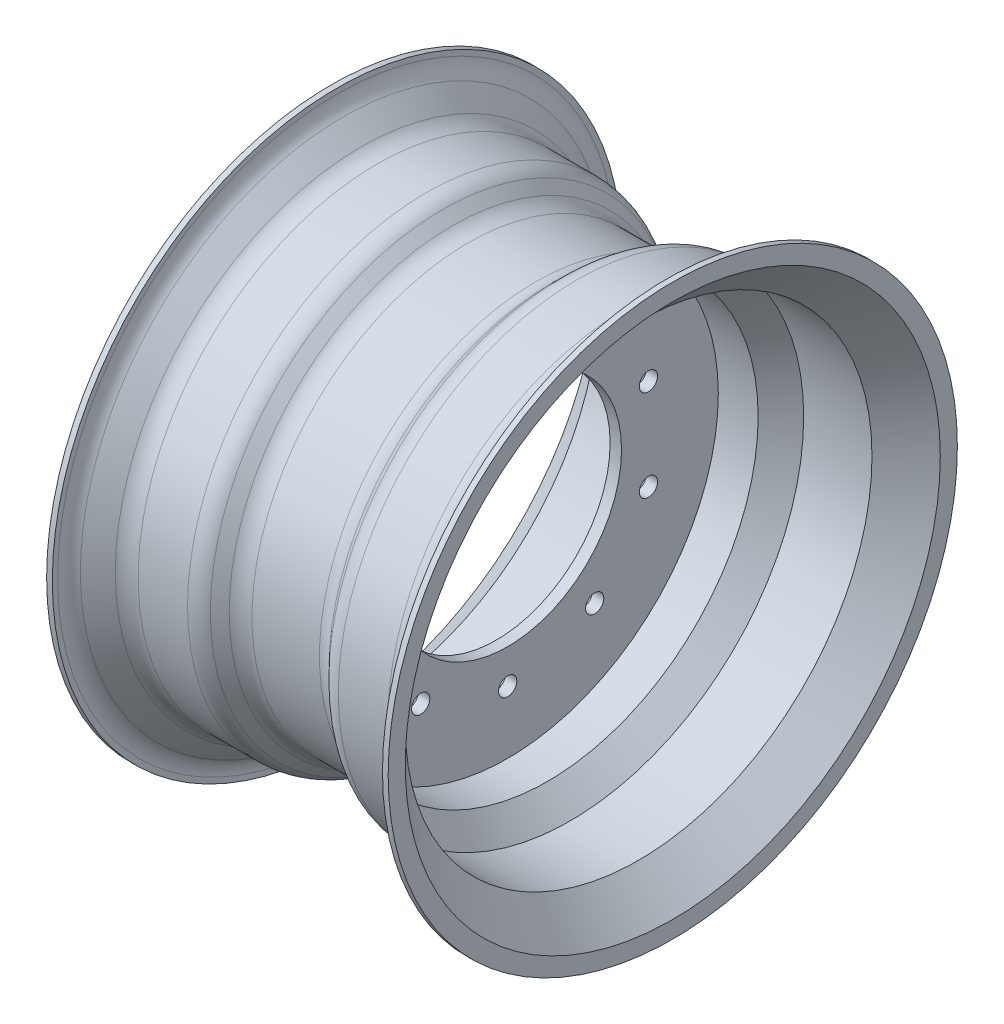
ISO-10303-21;
HEADER;
FILE_DESCRIPTION(('STEP AP214'),'2;1');
FILE_NAME('part.step','',(''),(''),'','','');
FILE_SCHEMA(('AUTOMOTIVE_DESIGN { 1 0 10303 214 1 1 1 1 }'));
ENDSEC;
DATA;
#1=APPLICATION_CONTEXT('core data for automotive mechanical design processes');
#2=APPLICATION_PROTOCOL_DEFINITION('international standard','automotive_design',2000,#1);
#3=PRODUCT_CONTEXT('',#1,'mechanical');
#4=PRODUCT('Part','Part','',(#3));
#5=PRODUCT_RELATED_PRODUCT_CATEGORY('part','',(#4));
#6=PRODUCT_DEFINITION_FORMATION('','',#4);
#7=PRODUCT_DEFINITION_CONTEXT('part definition',#1,'design');
#8=PRODUCT_DEFINITION('design','',#6,#7);
#9=PRODUCT_DEFINITION_SHAPE('','',#8);
#10=(LENGTH_UNIT() NAMED_UNIT(*) SI_UNIT(.MILLI.,.METRE.));
#11=(NAMED_UNIT(*) PLANE_ANGLE_UNIT() SI_UNIT($,.RADIAN.));
#12=(NAMED_UNIT(*) SI_UNIT($,.STERADIAN.) SOLID_ANGLE_UNIT());
#13=UNCERTAINTY_MEASURE_WITH_UNIT(LENGTH_MEASURE(1.E-05),#10,'distance_accuracy_value','');
#14=(GEOMETRIC_REPRESENTATION_CONTEXT(3) GLOBAL_UNCERTAINTY_ASSIGNED_CONTEXT((#13)) GLOBAL_UNIT_ASSIGNED_CONTEXT((#10,
#11,#12)) REPRESENTATION_CONTEXT('',''));
#15=CARTESIAN_POINT('',(0.,0.,0.));
#16=DIRECTION('',(0.,0.,1.));
#17=DIRECTION('',(1.,0.,0.));
#18=AXIS2_PLACEMENT_3D('',#15,#16,#17);
#19=CARTESIAN_POINT('',(0.,0.,0.));
#20=DIRECTION('',(1.,0.,0.));
#21=DIRECTION('',(0.,0.,-1.));
#22=AXIS2_PLACEMENT_3D('',#19,#20,#21);
#23=CYLINDRICAL_SURFACE('',#22,250.);
#24=CARTESIAN_POINT('',(-150.,0.,0.));
#25=DIRECTION('',(1.,0.,0.));
#26=DIRECTION('',(0.,0.,-1.));
#27=AXIS2_PLACEMENT_3D('',#24,#25,#26);
#28=CIRCLE('',#27,250.);
#29=CARTESIAN_POINT('',(-150.,0.,-250.));
#30=VERTEX_POINT('',#29);
#31=EDGE_CURVE('E133',#30,#30,#28,.T.);
#32=ORIENTED_EDGE('',*,*,#31,.T.);
#33=EDGE_LOOP('',(#32));
#34=FACE_BOUND('',#33,.T.);
#35=CARTESIAN_POINT('',(-145.,0.,0.));
#36=DIRECTION('',(1.,0.,0.));
#37=DIRECTION('',(0.,0.,-1.));
#38=AXIS2_PLACEMENT_3D('',#35,#36,#37);
#39=CIRCLE('',#38,250.);
#40=CARTESIAN_POINT('',(-145.,0.,-250.));
#41=VERTEX_POINT('',#40);
#42=EDGE_CURVE('E88',#41,#41,#39,.T.);
#43=ORIENTED_EDGE('',*,*,#42,.F.);
#44=EDGE_LOOP('',(#43));
#45=FACE_BOUND('',#44,.T.);
#46=ADVANCED_FACE('F32',(#34,#45),#23,.T.);
#47=CARTESIAN_POINT('',(-145.,250.,0.));
#48=DIRECTION('',(1.,0.,0.));
#49=DIRECTION('',(0.,0.,-1.));
#50=AXIS2_PLACEMENT_3D('',#47,#48,#49);
#51=PLANE('',#50);
#52=CARTESIAN_POINT('',(-145.,0.,0.));
#53=DIRECTION('',(1.,0.,0.));
#54=DIRECTION('',(0.,0.,-1.));
#55=AXIS2_PLACEMENT_3D('',#52,#53,#54);
#56=CIRCLE('',#55,245.355339059327);
#57=CARTESIAN_POINT('',(-145.,0.,-245.355339059327));
#58=VERTEX_POINT('',#57);
#59=EDGE_CURVE('E10',#58,#58,#56,.F.);
#60=ORIENTED_EDGE('',*,*,#59,.T.);
#61=EDGE_LOOP('',(#60));
#62=FACE_BOUND('',#61,.T.);
#63=ORIENTED_EDGE('',*,*,#42,.T.);
#64=EDGE_LOOP('',(#63));
#65=FACE_BOUND('',#64,.T.);
#66=ADVANCED_FACE('F267',(#62,#65),#51,.T.);
#67=CARTESIAN_POINT('',(-117.928932188134,0.,0.));
#68=DIRECTION('',(-1.,0.,0.));
#69=DIRECTION('',(0.,0.,1.));
#70=AXIS2_PLACEMENT_3D('',#67,#68,#69);
#71=CONICAL_SURFACE('',#70,210.,0.785398163397445);
#72=CARTESIAN_POINT('',(-123.786796564403,0.,0.));
#73=DIRECTION('',(-1.,0.,0.));
#74=DIRECTION('',(0.,0.,1.));
#75=AXIS2_PLACEMENT_3D('',#72,#73,#74);
#76=CIRCLE('',#75,215.857864376269);
#77=CARTESIAN_POINT('',(-123.786796564403,0.,215.857864376269));
#78=VERTEX_POINT('',#77);
#79=EDGE_CURVE('E43',#78,#78,#76,.T.);
#80=ORIENTED_EDGE('',*,*,#79,.T.);
#81=EDGE_LOOP('',(#80));
#82=FACE_BOUND('',#81,.T.);
#83=CARTESIAN_POINT('',(-139.142135623731,0.,0.));
#84=DIRECTION('',(-1.,0.,0.));
#85=DIRECTION('',(0.,0.,1.));
#86=AXIS2_PLACEMENT_3D('',#83,#84,#85);
#87=CIRCLE('',#86,231.213203435596);
#88=CARTESIAN_POINT('',(-139.142135623731,0.,231.213203435596));
#89=VERTEX_POINT('',#88);
#90=EDGE_CURVE('E47',#89,#89,#87,.F.);
#91=ORIENTED_EDGE('',*,*,#90,.T.);
#92=EDGE_LOOP('',(#91));
#93=FACE_BOUND('',#92,.T.);
#94=ADVANCED_FACE('F272',(#82,#93),#71,.T.);
#95=CARTESIAN_POINT('',(0.,0.,0.));
#96=DIRECTION('',(1.,0.,0.));
#97=DIRECTION('',(0.,0.,-1.));
#98=AXIS2_PLACEMENT_3D('',#95,#96,#97);
#99=CYLINDRICAL_SURFACE('',#98,210.);
#100=CARTESIAN_POINT('',(-66.2132034355965,0.,0.));
#101=DIRECTION('',(-1.,0.,0.));
#102=DIRECTION('',(0.,0.,1.));
#103=AXIS2_PLACEMENT_3D('',#100,#101,#102);
#104=CIRCLE('',#103,210.);
#105=CARTESIAN_POINT('',(-66.2132034355965,0.,210.));
#106=VERTEX_POINT('',#105);
#107=EDGE_CURVE('E52',#106,#106,#104,.T.);
#108=ORIENTED_EDGE('',*,*,#107,.T.);
#109=EDGE_LOOP('',(#108));
#110=FACE_BOUND('',#109,.T.);
#111=CARTESIAN_POINT('',(-109.644660940673,0.,0.));
#112=DIRECTION('',(1.,0.,0.));
#113=DIRECTION('',(0.,0.,-1.));
#114=AXIS2_PLACEMENT_3D('',#111,#112,#113);
#115=CIRCLE('',#114,210.);
#116=CARTESIAN_POINT('',(-109.644660940673,0.,-210.));
#117=VERTEX_POINT('',#116);
#118=EDGE_CURVE('E55',#117,#117,#115,.T.);
#119=ORIENTED_EDGE('',*,*,#118,.T.);
#120=EDGE_LOOP('',(#119));
#121=FACE_BOUND('',#120,.T.);
#122=ADVANCED_FACE('F277',(#110,#121),#99,.T.);
#123=CARTESIAN_POINT('',(-37.9289321881345,0.,0.));
#124=DIRECTION('',(-1.,0.,0.));
#125=DIRECTION('',(0.,0.,1.));
#126=AXIS2_PLACEMENT_3D('',#123,#124,#125);
#127=CONICAL_SURFACE('',#126,190.,0.785398163397448);
#128=CARTESIAN_POINT('',(-43.7867965644036,0.,0.));
#129=DIRECTION('',(-1.,0.,0.));
#130=DIRECTION('',(0.,0.,1.));
#131=AXIS2_PLACEMENT_3D('',#128,#129,#130);
#132=CIRCLE('',#131,195.857864376269);
#133=CARTESIAN_POINT('',(-43.7867965644036,0.,195.857864376269));
#134=VERTEX_POINT('',#133);
#135=EDGE_CURVE('E58',#134,#134,#132,.T.);
#136=ORIENTED_EDGE('',*,*,#135,.T.);
#137=EDGE_LOOP('',(#136));
#138=FACE_BOUND('',#137,.T.);
#139=CARTESIAN_POINT('',(-52.0710678118655,0.,0.));
#140=DIRECTION('',(1.,0.,0.));
#141=DIRECTION('',(0.,0.,-1.));
#142=AXIS2_PLACEMENT_3D('',#139,#140,#141);
#143=CIRCLE('',#142,204.142135623731);
#144=CARTESIAN_POINT('',(-52.0710678118655,0.,-204.142135623731));
#145=VERTEX_POINT('',#144);
#146=EDGE_CURVE('E61',#145,#145,#143,.T.);
#147=ORIENTED_EDGE('',*,*,#146,.T.);
#148=EDGE_LOOP('',(#147));
#149=FACE_BOUND('',#148,.T.);
#150=ADVANCED_FACE('F338',(#138,#149),#127,.T.);
#151=CARTESIAN_POINT('',(0.,0.,0.));
#152=DIRECTION('',(1.,0.,0.));
#153=DIRECTION('',(0.,0.,-1.));
#154=AXIS2_PLACEMENT_3D('',#151,#152,#153);
#155=CYLINDRICAL_SURFACE('',#154,190.);
#156=CARTESIAN_POINT('',(29.6446609406726,0.,0.));
#157=DIRECTION('',(1.,0.,0.));
#158=DIRECTION('',(0.,0.,-1.));
#159=AXIS2_PLACEMENT_3D('',#156,#157,#158);
#160=CIRCLE('',#159,190.);
#161=CARTESIAN_POINT('',(29.6446609406726,0.,-190.));
#162=VERTEX_POINT('',#161);
#163=EDGE_CURVE('E64',#162,#162,#160,.F.);
#164=ORIENTED_EDGE('',*,*,#163,.T.);
#165=EDGE_LOOP('',(#164));
#166=FACE_BOUND('',#165,.T.);
#167=CARTESIAN_POINT('',(-29.6446609406726,0.,0.));
#168=DIRECTION('',(1.,0.,0.));
#169=DIRECTION('',(0.,0.,-1.));
#170=AXIS2_PLACEMENT_3D('',#167,#168,#169);
#171=CIRCLE('',#170,190.);
#172=CARTESIAN_POINT('',(-29.6446609406726,0.,-190.));
#173=VERTEX_POINT('',#172);
#174=EDGE_CURVE('E67',#173,#173,#171,.T.);
#175=ORIENTED_EDGE('',*,*,#174,.T.);
#176=EDGE_LOOP('',(#175));
#177=FACE_BOUND('',#176,.T.);
#178=ADVANCED_FACE('F334',(#166,#177),#155,.T.);
#179=CARTESIAN_POINT('',(57.9289321881346,0.,0.));
#180=DIRECTION('',(1.,0.,0.));
#181=DIRECTION('',(0.,0.,-1.));
#182=AXIS2_PLACEMENT_3D('',#179,#180,#181);
#183=CONICAL_SURFACE('',#182,210.,0.785398163397448);
#184=CARTESIAN_POINT('',(52.0710678118655,0.,0.));
#185=DIRECTION('',(-1.,0.,0.));
#186=DIRECTION('',(0.,0.,1.));
#187=AXIS2_PLACEMENT_3D('',#184,#185,#186);
#188=CIRCLE('',#187,204.142135623731);
#189=CARTESIAN_POINT('',(52.0710678118655,0.,204.142135623731));
#190=VERTEX_POINT('',#189);
#191=EDGE_CURVE('E70',#190,#190,#188,.T.);
#192=ORIENTED_EDGE('',*,*,#191,.T.);
#193=EDGE_LOOP('',(#192));
#194=FACE_BOUND('',#193,.T.);
#195=CARTESIAN_POINT('',(43.7867965644036,0.,0.));
#196=DIRECTION('',(1.,0.,0.));
#197=DIRECTION('',(0.,0.,-1.));
#198=AXIS2_PLACEMENT_3D('',#195,#196,#197);
#199=CIRCLE('',#198,195.857864376269);
#200=CARTESIAN_POINT('',(43.7867965644036,0.,-195.857864376269));
#201=VERTEX_POINT('',#200);
#202=EDGE_CURVE('E73',#201,#201,#199,.T.);
#203=ORIENTED_EDGE('',*,*,#202,.T.);
#204=EDGE_LOOP('',(#203));
#205=FACE_BOUND('',#204,.T.);
#206=ADVANCED_FACE('F327',(#194,#205),#183,.T.);
#207=CARTESIAN_POINT('',(0.,0.,0.));
#208=DIRECTION('',(1.,0.,0.));
#209=DIRECTION('',(0.,0.,-1.));
#210=AXIS2_PLACEMENT_3D('',#207,#208,#209);
#211=CYLINDRICAL_SURFACE('',#210,210.);
#212=CARTESIAN_POINT('',(109.644660940673,0.,0.));
#213=DIRECTION('',(1.,0.,0.));
#214=DIRECTION('',(0.,0.,-1.));
#215=AXIS2_PLACEMENT_3D('',#212,#213,#214);
#216=CIRCLE('',#215,210.);
#217=CARTESIAN_POINT('',(109.644660940673,0.,-210.));
#218=VERTEX_POINT('',#217);
#219=EDGE_CURVE('E76',#218,#218,#216,.F.);
#220=ORIENTED_EDGE('',*,*,#219,.T.);
#221=EDGE_LOOP('',(#220));
#222=FACE_BOUND('',#221,.T.);
#223=CARTESIAN_POINT('',(66.2132034355965,0.,0.));
#224=DIRECTION('',(-1.,0.,0.));
#225=DIRECTION('',(0.,0.,1.));
#226=AXIS2_PLACEMENT_3D('',#223,#224,#225);
#227=CIRCLE('',#226,210.);
#228=CARTESIAN_POINT('',(66.2132034355965,0.,210.));
#229=VERTEX_POINT('',#228);
#230=EDGE_CURVE('E79',#229,#229,#227,.F.);
#231=ORIENTED_EDGE('',*,*,#230,.T.);
#232=EDGE_LOOP('',(#231));
#233=FACE_BOUND('',#232,.T.);
#234=ADVANCED_FACE('F318',(#222,#233),#211,.T.);
#235=CARTESIAN_POINT('',(145.,0.,0.));
#236=DIRECTION('',(1.,0.,0.));
#237=DIRECTION('',(0.,0.,-1.));
#238=AXIS2_PLACEMENT_3D('',#235,#236,#237);
#239=CONICAL_SURFACE('',#238,237.071067811865,0.785398163397446);
#240=CARTESIAN_POINT('',(123.786796564403,0.,0.));
#241=DIRECTION('',(1.,0.,0.));
#242=DIRECTION('',(0.,0.,-1.));
#243=AXIS2_PLACEMENT_3D('',#240,#241,#242);
#244=CIRCLE('',#243,215.857864376269);
#245=CARTESIAN_POINT('',(123.786796564403,0.,-215.857864376269));
#246=VERTEX_POINT('',#245);
#247=EDGE_CURVE('E82',#246,#246,#244,.T.);
#248=ORIENTED_EDGE('',*,*,#247,.T.);
#249=EDGE_LOOP('',(#248));
#250=FACE_BOUND('',#249,.T.);
#251=CARTESIAN_POINT('',(139.142135623731,0.,0.));
#252=DIRECTION('',(1.,0.,0.));
#253=DIRECTION('',(0.,0.,-1.));
#254=AXIS2_PLACEMENT_3D('',#251,#252,#253);
#255=CIRCLE('',#254,231.213203435596);
#256=CARTESIAN_POINT('',(139.142135623731,0.,-231.213203435596));
#257=VERTEX_POINT('',#256);
#258=EDGE_CURVE('E85',#257,#257,#255,.F.);
#259=ORIENTED_EDGE('',*,*,#258,.T.);
#260=EDGE_LOOP('',(#259));
#261=FACE_BOUND('',#260,.T.);
#262=ADVANCED_FACE('F315',(#250,#261),#239,.T.);
#263=CARTESIAN_POINT('',(145.,250.,0.));
#264=DIRECTION('',(-1.,0.,0.));
#265=DIRECTION('',(0.,0.,1.));
#266=AXIS2_PLACEMENT_3D('',#263,#264,#265);
#267=PLANE('',#266);
#268=CARTESIAN_POINT('',(145.,0.,0.));
#269=DIRECTION('',(-1.,0.,0.));
#270=DIRECTION('',(0.,0.,1.));
#271=AXIS2_PLACEMENT_3D('',#268,#269,#270);
#272=CIRCLE('',#271,245.355339059327);
#273=CARTESIAN_POINT('',(145.,0.,245.355339059327));
#274=VERTEX_POINT('',#273);
#275=EDGE_CURVE('E39',#274,#274,#272,.F.);
#276=ORIENTED_EDGE('',*,*,#275,.T.);
#277=EDGE_LOOP('',(#276));
#278=FACE_BOUND('',#277,.T.);
#279=CARTESIAN_POINT('',(145.,0.,0.));
#280=DIRECTION('',(1.,0.,0.));
#281=DIRECTION('',(0.,0.,-1.));
#282=AXIS2_PLACEMENT_3D('',#279,#280,#281);
#283=CIRCLE('',#282,250.);
#284=CARTESIAN_POINT('',(145.,0.,-250.));
#285=VERTEX_POINT('',#284);
#286=EDGE_CURVE('E91',#285,#285,#283,.T.);
#287=ORIENTED_EDGE('',*,*,#286,.F.);
#288=EDGE_LOOP('',(#287));
#289=FACE_BOUND('',#288,.T.);
#290=ADVANCED_FACE('F317',(#278,#289),#267,.T.);
#291=CARTESIAN_POINT('',(0.,0.,0.));
#292=DIRECTION('',(1.,0.,0.));
#293=DIRECTION('',(0.,0.,-1.));
#294=AXIS2_PLACEMENT_3D('',#291,#292,#293);
#295=CYLINDRICAL_SURFACE('',#294,250.);
#296=ORIENTED_EDGE('',*,*,#286,.T.);
#297=EDGE_LOOP('',(#296));
#298=FACE_BOUND('',#297,.T.);
#299=CARTESIAN_POINT('',(150.,0.,0.));
#300=DIRECTION('',(1.,0.,0.));
#301=DIRECTION('',(0.,0.,-1.));
#302=AXIS2_PLACEMENT_3D('',#299,#300,#301);
#303=CIRCLE('',#302,250.);
#304=CARTESIAN_POINT('',(150.,0.,-250.));
#305=VERTEX_POINT('',#304);
#306=EDGE_CURVE('E94',#305,#305,#303,.T.);
#307=ORIENTED_EDGE('',*,*,#306,.F.);
#308=EDGE_LOOP('',(#307));
#309=FACE_BOUND('',#308,.T.);
#310=ADVANCED_FACE('F325',(#298,#309),#295,.T.);
#311=CARTESIAN_POINT('',(150.,250.,0.));
#312=DIRECTION('',(1.,0.,0.));
#313=DIRECTION('',(0.,0.,-1.));
#314=AXIS2_PLACEMENT_3D('',#311,#312,#313);
#315=PLANE('',#314);
#316=ORIENTED_EDGE('',*,*,#306,.T.);
#317=EDGE_LOOP('',(#316));
#318=FACE_BOUND('',#317,.T.);
#319=CARTESIAN_POINT('',(150.,0.,0.));
#320=DIRECTION('',(1.,0.,0.));
#321=DIRECTION('',(0.,0.,-1.));
#322=AXIS2_PLACEMENT_3D('',#319,#320,#321);
#323=CIRCLE('',#322,235.);
#324=CARTESIAN_POINT('',(150.,0.,-235.));
#325=VERTEX_POINT('',#324);
#326=EDGE_CURVE('E97',#325,#325,#323,.T.);
#327=ORIENTED_EDGE('',*,*,#326,.F.);
#328=EDGE_LOOP('',(#327));
#329=FACE_BOUND('',#328,.T.);
#330=ADVANCED_FACE('F577',(#318,#329),#315,.T.);
#331=CARTESIAN_POINT('',(120.,0.,0.));
#332=DIRECTION('',(1.,0.,0.));
#333=DIRECTION('',(0.,0.,-1.));
#334=AXIS2_PLACEMENT_3D('',#331,#332,#333);
#335=CONICAL_SURFACE('',#334,205.,0.785398163397447);
#336=ORIENTED_EDGE('',*,*,#326,.T.);
#337=EDGE_LOOP('',(#336));
#338=FACE_BOUND('',#337,.T.);
#339=CARTESIAN_POINT('',(120.,0.,0.));
#340=DIRECTION('',(1.,0.,0.));
#341=DIRECTION('',(0.,0.,-1.));
#342=AXIS2_PLACEMENT_3D('',#339,#340,#341);
#343=CIRCLE('',#342,205.);
#344=CARTESIAN_POINT('',(120.,0.,-205.));
#345=VERTEX_POINT('',#344);
#346=EDGE_CURVE('E100',#345,#345,#343,.T.);
#347=ORIENTED_EDGE('',*,*,#346,.F.);
#348=EDGE_LOOP('',(#347));
#349=FACE_BOUND('',#348,.T.);
#350=ADVANCED_FACE('F573',(#338,#349),#335,.F.);
#351=CARTESIAN_POINT('',(0.,0.,0.));
#352=DIRECTION('',(1.,0.,0.));
#353=DIRECTION('',(0.,0.,-1.));
#354=AXIS2_PLACEMENT_3D('',#351,#352,#353);
#355=CYLINDRICAL_SURFACE('',#354,205.);
#356=ORIENTED_EDGE('',*,*,#346,.T.);
#357=EDGE_LOOP('',(#356));
#358=FACE_BOUND('',#357,.T.);
#359=CARTESIAN_POINT('',(60.,0.,0.));
#360=DIRECTION('',(1.,0.,0.));
#361=DIRECTION('',(0.,0.,-1.));
#362=AXIS2_PLACEMENT_3D('',#359,#360,#361);
#363=CIRCLE('',#362,205.);
#364=CARTESIAN_POINT('',(60.,0.,-205.));
#365=VERTEX_POINT('',#364);
#366=EDGE_CURVE('E103',#365,#365,#363,.T.);
#367=ORIENTED_EDGE('',*,*,#366,.F.);
#368=EDGE_LOOP('',(#367));
#369=FACE_BOUND('',#368,.T.);
#370=ADVANCED_FACE('F569',(#358,#369),#355,.F.);
#371=CARTESIAN_POINT('',(40.0000000000001,0.,0.));
#372=DIRECTION('',(1.,0.,0.));
#373=DIRECTION('',(0.,0.,-1.));
#374=AXIS2_PLACEMENT_3D('',#371,#372,#373);
#375=CONICAL_SURFACE('',#374,185.,0.78539816339745);
#376=ORIENTED_EDGE('',*,*,#366,.T.);
#377=EDGE_LOOP('',(#376));
#378=FACE_BOUND('',#377,.T.);
#379=CARTESIAN_POINT('',(40.0000000000001,0.,0.));
#380=DIRECTION('',(1.,0.,0.));
#381=DIRECTION('',(0.,0.,-1.));
#382=AXIS2_PLACEMENT_3D('',#379,#380,#381);
#383=CIRCLE('',#382,185.);
#384=CARTESIAN_POINT('',(40.0000000000001,0.,-185.));
#385=VERTEX_POINT('',#384);
#386=EDGE_CURVE('E106',#385,#385,#383,.T.);
#387=ORIENTED_EDGE('',*,*,#386,.F.);
#388=EDGE_LOOP('',(#387));
#389=FACE_BOUND('',#388,.T.);
#390=ADVANCED_FACE('F565',(#378,#389),#375,.F.);
#391=CARTESIAN_POINT('',(0.,0.,0.));
#392=DIRECTION('',(1.,0.,0.));
#393=DIRECTION('',(0.,0.,-1.));
#394=AXIS2_PLACEMENT_3D('',#391,#392,#393);
#395=CYLINDRICAL_SURFACE('',#394,185.);
#396=ORIENTED_EDGE('',*,*,#386,.T.);
#397=EDGE_LOOP('',(#396));
#398=FACE_BOUND('',#397,.T.);
#399=CARTESIAN_POINT('',(5.00000000000002,0.,0.));
#400=DIRECTION('',(1.,0.,0.));
#401=DIRECTION('',(0.,0.,-1.));
#402=AXIS2_PLACEMENT_3D('',#399,#400,#401);
#403=CIRCLE('',#402,185.);
#404=CARTESIAN_POINT('',(5.00000000000002,0.,-185.));
#405=VERTEX_POINT('',#404);
#406=EDGE_CURVE('E109',#405,#405,#403,.T.);
#407=ORIENTED_EDGE('',*,*,#406,.F.);
#408=EDGE_LOOP('',(#407));
#409=FACE_BOUND('',#408,.T.);
#410=ADVANCED_FACE('F212',(#398,#409),#395,.F.);
#411=CARTESIAN_POINT('',(5.00000000000003,185.,0.));
#412=DIRECTION('',(1.,0.,0.));
#413=DIRECTION('',(0.,0.,-1.));
#414=AXIS2_PLACEMENT_3D('',#411,#412,#413);
#415=PLANE('',#414);
#416=CARTESIAN_POINT('',(5.00000000000003,105.172209268744,-76.4120827980201));
#417=DIRECTION('',(1.,0.,0.));
#418=DIRECTION('',(0.,-0.587785252292462,-0.809016994374955));
#419=AXIS2_PLACEMENT_3D('',#416,#417,#418);
#420=CIRCLE('',#419,8.);
#421=CARTESIAN_POINT('',(5.00000000000003,100.469927250404,-82.8842187530198));
#422=VERTEX_POINT('',#421);
#423=EDGE_CURVE('E149',#422,#422,#420,.T.);
#424=ORIENTED_EDGE('',*,*,#423,.F.);
#425=EDGE_LOOP('',(#424));
#426=FACE_BOUND('',#425,.T.);
#427=CARTESIAN_POINT('',(5.00000000000003,40.1722092687446,-123.63734711837));
#428=DIRECTION('',(1.,0.,0.));
#429=DIRECTION('',(0.,-0.95105651629515,-0.309016994374958));
#430=AXIS2_PLACEMENT_3D('',#427,#428,#429);
#431=CIRCLE('',#430,8.);
#432=CARTESIAN_POINT('',(5.00000000000003,32.5637571383834,-126.109483073369));
#433=VERTEX_POINT('',#432);
#434=EDGE_CURVE('E155',#433,#433,#431,.T.);
#435=ORIENTED_EDGE('',*,*,#434,.F.);
#436=EDGE_LOOP('',(#435));
#437=FACE_BOUND('',#436,.T.);
#438=CARTESIAN_POINT('',(5.00000000000003,-40.172209268742,-123.63734711837));
#439=DIRECTION('',(1.,0.,0.));
#440=DIRECTION('',(0.,-0.951056516295157,0.309016994374938));
#441=AXIS2_PLACEMENT_3D('',#438,#439,#440);
#442=CIRCLE('',#441,8.);
#443=CARTESIAN_POINT('',(5.00000000000003,-47.7806613991032,-121.165211163371));
#444=VERTEX_POINT('',#443);
#445=EDGE_CURVE('E161',#444,#444,#442,.T.);
#446=ORIENTED_EDGE('',*,*,#445,.F.);
#447=EDGE_LOOP('',(#446));
#448=FACE_BOUND('',#447,.T.);
#449=CARTESIAN_POINT('',(5.00000000000003,-105.172209268742,-76.4120827980224));
#450=DIRECTION('',(1.,0.,0.));
#451=DIRECTION('',(0.,-0.58778525229248,0.809016994374942));
#452=AXIS2_PLACEMENT_3D('',#449,#450,#451);
#453=CIRCLE('',#452,8.);
#454=CARTESIAN_POINT('',(5.00000000000003,-109.874491287082,-69.9399468430229));
#455=VERTEX_POINT('',#454);
#456=EDGE_CURVE('E167',#455,#455,#453,.T.);
#457=ORIENTED_EDGE('',*,*,#456,.F.);
#458=EDGE_LOOP('',(#457));
#459=FACE_BOUND('',#458,.T.);
#460=CARTESIAN_POINT('',(5.00000000000003,-130.,0.));
#461=DIRECTION('',(1.,0.,0.));
#462=DIRECTION('',(0.,0.,1.));
#463=AXIS2_PLACEMENT_3D('',#460,#461,#462);
#464=CIRCLE('',#463,8.);
#465=CARTESIAN_POINT('',(5.00000000000003,-130.,8.));
#466=VERTEX_POINT('',#465);
#467=EDGE_CURVE('E173',#466,#466,#464,.T.);
#468=ORIENTED_EDGE('',*,*,#467,.F.);
#469=EDGE_LOOP('',(#468));
#470=FACE_BOUND('',#469,.T.);
#471=CARTESIAN_POINT('',(5.00000000000003,-105.172209268744,76.4120827980209));
#472=DIRECTION('',(1.,0.,0.));
#473=DIRECTION('',(0.,0.587785252292469,0.809016994374951));
#474=AXIS2_PLACEMENT_3D('',#471,#472,#473);
#475=CIRCLE('',#474,8.);
#476=CARTESIAN_POINT('',(5.00000000000003,-100.469927250404,82.8842187530205));
#477=VERTEX_POINT('',#476);
#478=EDGE_CURVE('E179',#477,#477,#475,.T.);
#479=ORIENTED_EDGE('',*,*,#478,.F.);
#480=EDGE_LOOP('',(#479));
#481=FACE_BOUND('',#480,.T.);
#482=CARTESIAN_POINT('',(5.00000000000003,-40.1722092687437,123.63734711837));
#483=DIRECTION('',(1.,0.,0.));
#484=DIRECTION('',(0.,0.951056516295152,0.309016994374952));
#485=AXIS2_PLACEMENT_3D('',#482,#483,#484);
#486=CIRCLE('',#485,8.);
#487=CARTESIAN_POINT('',(5.00000000000003,-32.5637571383825,126.109483073369));
#488=VERTEX_POINT('',#487);
#489=EDGE_CURVE('E185',#488,#488,#486,.T.);
#490=ORIENTED_EDGE('',*,*,#489,.F.);
#491=EDGE_LOOP('',(#490));
#492=FACE_BOUND('',#491,.T.);
#493=CARTESIAN_POINT('',(5.00000000000003,40.1722092687428,123.63734711837));
#494=DIRECTION('',(1.,0.,0.));
#495=DIRECTION('',(0.,0.951056516295155,-0.309016994374945));
#496=AXIS2_PLACEMENT_3D('',#493,#494,#495);
#497=CIRCLE('',#496,8.);
#498=CARTESIAN_POINT('',(5.00000000000003,47.7806613991041,121.165211163371));
#499=VERTEX_POINT('',#498);
#500=EDGE_CURVE('E191',#499,#499,#497,.T.);
#501=ORIENTED_EDGE('',*,*,#500,.F.);
#502=EDGE_LOOP('',(#501));
#503=FACE_BOUND('',#502,.T.);
#504=CARTESIAN_POINT('',(5.00000000000003,105.172209268743,76.4120827980217));
#505=DIRECTION('',(1.,0.,0.));
#506=DIRECTION('',(0.,0.587785252292474,-0.809016994374947));
#507=AXIS2_PLACEMENT_3D('',#504,#505,#506);
#508=CIRCLE('',#507,8.);
#509=CARTESIAN_POINT('',(5.00000000000003,109.874491287083,69.9399468430221));
#510=VERTEX_POINT('',#509);
#511=EDGE_CURVE('E143',#510,#510,#508,.T.);
#512=ORIENTED_EDGE('',*,*,#511,.F.);
#513=EDGE_LOOP('',(#512));
#514=FACE_BOUND('',#513,.T.);
#515=CARTESIAN_POINT('',(5.00000000000003,130.,0.));
#516=DIRECTION('',(1.,0.,0.));
#517=DIRECTION('',(0.,0.,-1.));
#518=AXIS2_PLACEMENT_3D('',#515,#516,#517);
#519=CIRCLE('',#518,8.);
#520=CARTESIAN_POINT('',(5.00000000000003,130.,-8.));
#521=VERTEX_POINT('',#520);
#522=EDGE_CURVE('E137',#521,#521,#519,.T.);
#523=ORIENTED_EDGE('',*,*,#522,.F.);
#524=EDGE_LOOP('',(#523));
#525=FACE_BOUND('',#524,.T.);
#526=ORIENTED_EDGE('',*,*,#406,.T.);
#527=EDGE_LOOP('',(#526));
#528=FACE_BOUND('',#527,.T.);
#529=CARTESIAN_POINT('',(5.00000000000003,0.,0.));
#530=DIRECTION('',(1.,0.,0.));
#531=DIRECTION('',(0.,0.,-1.));
#532=AXIS2_PLACEMENT_3D('',#529,#530,#531);
#533=CIRCLE('',#532,100.);
#534=CARTESIAN_POINT('',(5.00000000000003,0.,-100.));
#535=VERTEX_POINT('',#534);
#536=EDGE_CURVE('E112',#535,#535,#533,.T.);
#537=ORIENTED_EDGE('',*,*,#536,.F.);
#538=EDGE_LOOP('',(#537));
#539=FACE_BOUND('',#538,.T.);
#540=ADVANCED_FACE('F208',(#426,#437,#448,#459,#470,#481,#492,#503,#514,#525,#528,#539),#415,.T.);
#541=CARTESIAN_POINT('',(0.,0.,0.));
#542=DIRECTION('',(1.,0.,0.));
#543=DIRECTION('',(0.,0.,-1.));
#544=AXIS2_PLACEMENT_3D('',#541,#542,#543);
#545=CYLINDRICAL_SURFACE('',#544,100.);
#546=ORIENTED_EDGE('',*,*,#536,.T.);
#547=EDGE_LOOP('',(#546));
#548=FACE_BOUND('',#547,.T.);
#549=CARTESIAN_POINT('',(-4.99999999999999,0.,0.));
#550=DIRECTION('',(1.,0.,0.));
#551=DIRECTION('',(0.,0.,-1.));
#552=AXIS2_PLACEMENT_3D('',#549,#550,#551);
#553=CIRCLE('',#552,100.);
#554=CARTESIAN_POINT('',(-4.99999999999999,0.,-100.));
#555=VERTEX_POINT('',#554);
#556=EDGE_CURVE('E115',#555,#555,#553,.T.);
#557=ORIENTED_EDGE('',*,*,#556,.F.);
#558=EDGE_LOOP('',(#557));
#559=FACE_BOUND('',#558,.T.);
#560=ADVANCED_FACE('F211',(#548,#559),#545,.F.);
#561=CARTESIAN_POINT('',(-4.99999999999999,185.,0.));
#562=DIRECTION('',(-1.,0.,0.));
#563=DIRECTION('',(0.,0.,1.));
#564=AXIS2_PLACEMENT_3D('',#561,#562,#563);
#565=PLANE('',#564);
#566=CARTESIAN_POINT('',(-4.99999999999997,105.172209268744,-76.4120827980201));
#567=DIRECTION('',(1.,0.,0.));
#568=DIRECTION('',(0.,-0.587785252292462,-0.809016994374955));
#569=AXIS2_PLACEMENT_3D('',#566,#567,#568);
#570=CIRCLE('',#569,8.);
#571=CARTESIAN_POINT('',(-4.99999999999997,100.469927250404,-82.8842187530198));
#572=VERTEX_POINT('',#571);
#573=EDGE_CURVE('E152',#572,#572,#570,.T.);
#574=ORIENTED_EDGE('',*,*,#573,.T.);
#575=EDGE_LOOP('',(#574));
#576=FACE_BOUND('',#575,.T.);
#577=CARTESIAN_POINT('',(-4.99999999999997,40.1722092687446,-123.63734711837));
#578=DIRECTION('',(1.,0.,0.));
#579=DIRECTION('',(0.,-0.95105651629515,-0.309016994374958));
#580=AXIS2_PLACEMENT_3D('',#577,#578,#579);
#581=CIRCLE('',#580,8.);
#582=CARTESIAN_POINT('',(-4.99999999999997,32.5637571383834,-126.109483073369));
#583=VERTEX_POINT('',#582);
#584=EDGE_CURVE('E158',#583,#583,#581,.T.);
#585=ORIENTED_EDGE('',*,*,#584,.T.);
#586=EDGE_LOOP('',(#585));
#587=FACE_BOUND('',#586,.T.);
#588=CARTESIAN_POINT('',(-4.99999999999997,-40.172209268742,-123.63734711837));
#589=DIRECTION('',(1.,0.,0.));
#590=DIRECTION('',(0.,-0.951056516295157,0.309016994374938));
#591=AXIS2_PLACEMENT_3D('',#588,#589,#590);
#592=CIRCLE('',#591,8.);
#593=CARTESIAN_POINT('',(-4.99999999999997,-47.7806613991032,-121.165211163371));
#594=VERTEX_POINT('',#593);
#595=EDGE_CURVE('E164',#594,#594,#592,.T.);
#596=ORIENTED_EDGE('',*,*,#595,.T.);
#597=EDGE_LOOP('',(#596));
#598=FACE_BOUND('',#597,.T.);
#599=CARTESIAN_POINT('',(-4.99999999999997,-105.172209268742,-76.4120827980224));
#600=DIRECTION('',(1.,0.,0.));
#601=DIRECTION('',(0.,-0.58778525229248,0.809016994374942));
#602=AXIS2_PLACEMENT_3D('',#599,#600,#601);
#603=CIRCLE('',#602,8.);
#604=CARTESIAN_POINT('',(-4.99999999999997,-109.874491287082,-69.9399468430229));
#605=VERTEX_POINT('',#604);
#606=EDGE_CURVE('E170',#605,#605,#603,.T.);
#607=ORIENTED_EDGE('',*,*,#606,.T.);
#608=EDGE_LOOP('',(#607));
#609=FACE_BOUND('',#608,.T.);
#610=CARTESIAN_POINT('',(-4.99999999999997,-130.,0.));
#611=DIRECTION('',(1.,0.,0.));
#612=DIRECTION('',(0.,0.,1.));
#613=AXIS2_PLACEMENT_3D('',#610,#611,#612);
#614=CIRCLE('',#613,8.);
#615=CARTESIAN_POINT('',(-4.99999999999997,-130.,8.));
#616=VERTEX_POINT('',#615);
#617=EDGE_CURVE('E176',#616,#616,#614,.T.);
#618=ORIENTED_EDGE('',*,*,#617,.T.);
#619=EDGE_LOOP('',(#618));
#620=FACE_BOUND('',#619,.T.);
#621=CARTESIAN_POINT('',(-4.99999999999997,-105.172209268744,76.4120827980209));
#622=DIRECTION('',(1.,0.,0.));
#623=DIRECTION('',(0.,0.587785252292469,0.809016994374951));
#624=AXIS2_PLACEMENT_3D('',#621,#622,#623);
#625=CIRCLE('',#624,8.);
#626=CARTESIAN_POINT('',(-4.99999999999997,-100.469927250404,82.8842187530205));
#627=VERTEX_POINT('',#626);
#628=EDGE_CURVE('E182',#627,#627,#625,.T.);
#629=ORIENTED_EDGE('',*,*,#628,.T.);
#630=EDGE_LOOP('',(#629));
#631=FACE_BOUND('',#630,.T.);
#632=CARTESIAN_POINT('',(-4.99999999999997,-40.1722092687437,123.63734711837));
#633=DIRECTION('',(1.,0.,0.));
#634=DIRECTION('',(0.,0.951056516295152,0.309016994374952));
#635=AXIS2_PLACEMENT_3D('',#632,#633,#634);
#636=CIRCLE('',#635,8.);
#637=CARTESIAN_POINT('',(-4.99999999999997,-32.5637571383825,126.109483073369));
#638=VERTEX_POINT('',#637);
#639=EDGE_CURVE('E188',#638,#638,#636,.T.);
#640=ORIENTED_EDGE('',*,*,#639,.T.);
#641=EDGE_LOOP('',(#640));
#642=FACE_BOUND('',#641,.T.);
#643=CARTESIAN_POINT('',(-4.99999999999997,40.1722092687428,123.63734711837));
#644=DIRECTION('',(1.,0.,0.));
#645=DIRECTION('',(0.,0.951056516295155,-0.309016994374945));
#646=AXIS2_PLACEMENT_3D('',#643,#644,#645);
#647=CIRCLE('',#646,8.);
#648=CARTESIAN_POINT('',(-4.99999999999997,47.7806613991041,121.165211163371));
#649=VERTEX_POINT('',#648);
#650=EDGE_CURVE('E146',#649,#649,#647,.T.);
#651=ORIENTED_EDGE('',*,*,#650,.T.);
#652=EDGE_LOOP('',(#651));
#653=FACE_BOUND('',#652,.T.);
#654=CARTESIAN_POINT('',(-4.99999999999997,105.172209268743,76.4120827980217));
#655=DIRECTION('',(1.,0.,0.));
#656=DIRECTION('',(0.,0.587785252292474,-0.809016994374947));
#657=AXIS2_PLACEMENT_3D('',#654,#655,#656);
#658=CIRCLE('',#657,8.);
#659=CARTESIAN_POINT('',(-4.99999999999997,109.874491287083,69.9399468430221));
#660=VERTEX_POINT('',#659);
#661=EDGE_CURVE('E140',#660,#660,#658,.T.);
#662=ORIENTED_EDGE('',*,*,#661,.T.);
#663=EDGE_LOOP('',(#662));
#664=FACE_BOUND('',#663,.T.);
#665=CARTESIAN_POINT('',(-4.99999999999997,130.,0.));
#666=DIRECTION('',(1.,0.,0.));
#667=DIRECTION('',(0.,0.,-1.));
#668=AXIS2_PLACEMENT_3D('',#665,#666,#667);
#669=CIRCLE('',#668,8.);
#670=CARTESIAN_POINT('',(-4.99999999999997,130.,-8.));
#671=VERTEX_POINT('',#670);
#672=EDGE_CURVE('E136',#671,#671,#669,.T.);
#673=ORIENTED_EDGE('',*,*,#672,.T.);
#674=EDGE_LOOP('',(#673));
#675=FACE_BOUND('',#674,.T.);
#676=ORIENTED_EDGE('',*,*,#556,.T.);
#677=EDGE_LOOP('',(#676));
#678=FACE_BOUND('',#677,.T.);
#679=CARTESIAN_POINT('',(-5.,0.,0.));
#680=DIRECTION('',(1.,0.,0.));
#681=DIRECTION('',(0.,0.,-1.));
#682=AXIS2_PLACEMENT_3D('',#679,#680,#681);
#683=CIRCLE('',#682,185.);
#684=CARTESIAN_POINT('',(-5.,0.,-185.));
#685=VERTEX_POINT('',#684);
#686=EDGE_CURVE('E118',#685,#685,#683,.T.);
#687=ORIENTED_EDGE('',*,*,#686,.F.);
#688=EDGE_LOOP('',(#687));
#689=FACE_BOUND('',#688,.T.);
#690=ADVANCED_FACE('F197',(#576,#587,#598,#609,#620,#631,#642,#653,#664,#675,#678,#689),#565,.T.);
#691=CARTESIAN_POINT('',(0.,0.,0.));
#692=DIRECTION('',(1.,0.,0.));
#693=DIRECTION('',(0.,0.,-1.));
#694=AXIS2_PLACEMENT_3D('',#691,#692,#693);
#695=CYLINDRICAL_SURFACE('',#694,185.);
#696=ORIENTED_EDGE('',*,*,#686,.T.);
#697=EDGE_LOOP('',(#696));
#698=FACE_BOUND('',#697,.T.);
#699=CARTESIAN_POINT('',(-40.0000000000001,0.,0.));
#700=DIRECTION('',(1.,0.,0.));
#701=DIRECTION('',(0.,0.,-1.));
#702=AXIS2_PLACEMENT_3D('',#699,#700,#701);
#703=CIRCLE('',#702,185.);
#704=CARTESIAN_POINT('',(-40.0000000000001,0.,-185.));
#705=VERTEX_POINT('',#704);
#706=EDGE_CURVE('E121',#705,#705,#703,.T.);
#707=ORIENTED_EDGE('',*,*,#706,.F.);
#708=EDGE_LOOP('',(#707));
#709=FACE_BOUND('',#708,.T.);
#710=ADVANCED_FACE('F230',(#698,#709),#695,.F.);
#711=CARTESIAN_POINT('',(-60.,0.,0.));
#712=DIRECTION('',(-1.,0.,0.));
#713=DIRECTION('',(0.,0.,1.));
#714=AXIS2_PLACEMENT_3D('',#711,#712,#713);
#715=CONICAL_SURFACE('',#714,205.,0.78539816339745);
#716=ORIENTED_EDGE('',*,*,#706,.T.);
#717=EDGE_LOOP('',(#716));
#718=FACE_BOUND('',#717,.T.);
#719=CARTESIAN_POINT('',(-60.,0.,0.));
#720=DIRECTION('',(1.,0.,0.));
#721=DIRECTION('',(0.,0.,-1.));
#722=AXIS2_PLACEMENT_3D('',#719,#720,#721);
#723=CIRCLE('',#722,205.);
#724=CARTESIAN_POINT('',(-60.,0.,-205.));
#725=VERTEX_POINT('',#724);
#726=EDGE_CURVE('E124',#725,#725,#723,.T.);
#727=ORIENTED_EDGE('',*,*,#726,.F.);
#728=EDGE_LOOP('',(#727));
#729=FACE_BOUND('',#728,.T.);
#730=ADVANCED_FACE('F237',(#718,#729),#715,.F.);
#731=CARTESIAN_POINT('',(0.,0.,0.));
#732=DIRECTION('',(1.,0.,0.));
#733=DIRECTION('',(0.,0.,-1.));
#734=AXIS2_PLACEMENT_3D('',#731,#732,#733);
#735=CYLINDRICAL_SURFACE('',#734,205.);
#736=ORIENTED_EDGE('',*,*,#726,.T.);
#737=EDGE_LOOP('',(#736));
#738=FACE_BOUND('',#737,.T.);
#739=CARTESIAN_POINT('',(-120.,0.,0.));
#740=DIRECTION('',(1.,0.,0.));
#741=DIRECTION('',(0.,0.,-1.));
#742=AXIS2_PLACEMENT_3D('',#739,#740,#741);
#743=CIRCLE('',#742,205.);
#744=CARTESIAN_POINT('',(-120.,0.,-205.));
#745=VERTEX_POINT('',#744);
#746=EDGE_CURVE('E127',#745,#745,#743,.T.);
#747=ORIENTED_EDGE('',*,*,#746,.F.);
#748=EDGE_LOOP('',(#747));
#749=FACE_BOUND('',#748,.T.);
#750=ADVANCED_FACE('F243',(#738,#749),#735,.F.);
#751=CARTESIAN_POINT('',(-150.,0.,0.));
#752=DIRECTION('',(-1.,0.,0.));
#753=DIRECTION('',(0.,0.,1.));
#754=AXIS2_PLACEMENT_3D('',#751,#752,#753);
#755=CONICAL_SURFACE('',#754,235.,0.785398163397447);
#756=ORIENTED_EDGE('',*,*,#746,.T.);
#757=EDGE_LOOP('',(#756));
#758=FACE_BOUND('',#757,.T.);
#759=CARTESIAN_POINT('',(-150.,0.,0.));
#760=DIRECTION('',(1.,0.,0.));
#761=DIRECTION('',(0.,0.,-1.));
#762=AXIS2_PLACEMENT_3D('',#759,#760,#761);
#763=CIRCLE('',#762,235.);
#764=CARTESIAN_POINT('',(-150.,0.,-235.));
#765=VERTEX_POINT('',#764);
#766=EDGE_CURVE('E130',#765,#765,#763,.T.);
#767=ORIENTED_EDGE('',*,*,#766,.F.);
#768=EDGE_LOOP('',(#767));
#769=FACE_BOUND('',#768,.T.);
#770=ADVANCED_FACE('F249',(#758,#769),#755,.F.);
#771=CARTESIAN_POINT('',(-150.,250.,0.));
#772=DIRECTION('',(-1.,0.,0.));
#773=DIRECTION('',(0.,0.,1.));
#774=AXIS2_PLACEMENT_3D('',#771,#772,#773);
#775=PLANE('',#774);
#776=ORIENTED_EDGE('',*,*,#766,.T.);
#777=EDGE_LOOP('',(#776));
#778=FACE_BOUND('',#777,.T.);
#779=ORIENTED_EDGE('',*,*,#31,.F.);
#780=EDGE_LOOP('',(#779));
#781=FACE_BOUND('',#780,.T.);
#782=ADVANCED_FACE('F255',(#778,#781),#775,.T.);
#783=CARTESIAN_POINT('',(109.644660940673,0.,0.));
#784=DIRECTION('',(1.,0.,0.));
#785=DIRECTION('',(0.,0.,-1.));
#786=AXIS2_PLACEMENT_3D('',#783,#784,#785);
#787=TOROIDAL_SURFACE('',#786,230.,20.);
#788=ORIENTED_EDGE('',*,*,#219,.F.);
#789=EDGE_LOOP('',(#788));
#790=FACE_BOUND('',#789,.T.);
#791=ORIENTED_EDGE('',*,*,#247,.F.);
#792=EDGE_LOOP('',(#791));
#793=FACE_BOUND('',#792,.T.);
#794=ADVANCED_FACE('F261',(#790,#793),#787,.F.);
#795=CARTESIAN_POINT('',(66.2132034355965,0.,0.));
#796=DIRECTION('',(-1.,0.,0.));
#797=DIRECTION('',(0.,0.,1.));
#798=AXIS2_PLACEMENT_3D('',#795,#796,#797);
#799=TOROIDAL_SURFACE('',#798,190.,20.);
#800=ORIENTED_EDGE('',*,*,#191,.F.);
#801=EDGE_LOOP('',(#800));
#802=FACE_BOUND('',#801,.T.);
#803=ORIENTED_EDGE('',*,*,#230,.F.);
#804=EDGE_LOOP('',(#803));
#805=FACE_BOUND('',#804,.T.);
#806=ADVANCED_FACE('F284',(#802,#805),#799,.T.);
#807=CARTESIAN_POINT('',(29.6446609406726,0.,0.));
#808=DIRECTION('',(1.,0.,0.));
#809=DIRECTION('',(0.,0.,-1.));
#810=AXIS2_PLACEMENT_3D('',#807,#808,#809);
#811=TOROIDAL_SURFACE('',#810,210.,20.);
#812=ORIENTED_EDGE('',*,*,#163,.F.);
#813=EDGE_LOOP('',(#812));
#814=FACE_BOUND('',#813,.T.);
#815=ORIENTED_EDGE('',*,*,#202,.F.);
#816=EDGE_LOOP('',(#815));
#817=FACE_BOUND('',#816,.T.);
#818=ADVANCED_FACE('F288',(#814,#817),#811,.F.);
#819=CARTESIAN_POINT('',(-29.6446609406726,0.,0.));
#820=DIRECTION('',(1.,0.,0.));
#821=DIRECTION('',(0.,0.,-1.));
#822=AXIS2_PLACEMENT_3D('',#819,#820,#821);
#823=TOROIDAL_SURFACE('',#822,210.,20.);
#824=ORIENTED_EDGE('',*,*,#135,.F.);
#825=EDGE_LOOP('',(#824));
#826=FACE_BOUND('',#825,.T.);
#827=ORIENTED_EDGE('',*,*,#174,.F.);
#828=EDGE_LOOP('',(#827));
#829=FACE_BOUND('',#828,.T.);
#830=ADVANCED_FACE('F292',(#826,#829),#823,.F.);
#831=CARTESIAN_POINT('',(-66.2132034355965,0.,0.));
#832=DIRECTION('',(-1.,0.,0.));
#833=DIRECTION('',(0.,0.,1.));
#834=AXIS2_PLACEMENT_3D('',#831,#832,#833);
#835=TOROIDAL_SURFACE('',#834,190.,20.);
#836=ORIENTED_EDGE('',*,*,#107,.F.);
#837=EDGE_LOOP('',(#836));
#838=FACE_BOUND('',#837,.T.);
#839=ORIENTED_EDGE('',*,*,#146,.F.);
#840=EDGE_LOOP('',(#839));
#841=FACE_BOUND('',#840,.T.);
#842=ADVANCED_FACE('F296',(#838,#841),#835,.T.);
#843=CARTESIAN_POINT('',(-109.644660940673,0.,0.));
#844=DIRECTION('',(1.,0.,0.));
#845=DIRECTION('',(0.,0.,-1.));
#846=AXIS2_PLACEMENT_3D('',#843,#844,#845);
#847=TOROIDAL_SURFACE('',#846,230.,20.);
#848=ORIENTED_EDGE('',*,*,#79,.F.);
#849=EDGE_LOOP('',(#848));
#850=FACE_BOUND('',#849,.T.);
#851=ORIENTED_EDGE('',*,*,#118,.F.);
#852=EDGE_LOOP('',(#851));
#853=FACE_BOUND('',#852,.T.);
#854=ADVANCED_FACE('F300',(#850,#853),#847,.F.);
#855=CARTESIAN_POINT('',(125.,0.,0.));
#856=DIRECTION('',(-1.,0.,0.));
#857=DIRECTION('',(0.,0.,1.));
#858=AXIS2_PLACEMENT_3D('',#855,#856,#857);
#859=TOROIDAL_SURFACE('',#858,245.355339059327,20.);
#860=ORIENTED_EDGE('',*,*,#258,.F.);
#861=EDGE_LOOP('',(#860));
#862=FACE_BOUND('',#861,.T.);
#863=ORIENTED_EDGE('',*,*,#275,.F.);
#864=EDGE_LOOP('',(#863));
#865=FACE_BOUND('',#864,.T.);
#866=ADVANCED_FACE('F303',(#862,#865),#859,.F.);
#867=CARTESIAN_POINT('',(-125.,0.,0.));
#868=DIRECTION('',(1.,0.,0.));
#869=DIRECTION('',(0.,0.,-1.));
#870=AXIS2_PLACEMENT_3D('',#867,#868,#869);
#871=TOROIDAL_SURFACE('',#870,245.355339059327,20.);
#872=ORIENTED_EDGE('',*,*,#59,.F.);
#873=EDGE_LOOP('',(#872));
#874=FACE_BOUND('',#873,.T.);
#875=ORIENTED_EDGE('',*,*,#90,.F.);
#876=EDGE_LOOP('',(#875));
#877=FACE_BOUND('',#876,.T.);
#878=ADVANCED_FACE('F34',(#874,#877),#871,.F.);
#879=CARTESIAN_POINT('',(-4.99999999999997,130.,0.));
#880=DIRECTION('',(1.,0.,0.));
#881=DIRECTION('',(0.,0.,-1.));
#882=AXIS2_PLACEMENT_3D('',#879,#880,#881);
#883=CYLINDRICAL_SURFACE('',#882,8.);
#884=ORIENTED_EDGE('',*,*,#672,.F.);
#885=EDGE_LOOP('',(#884));
#886=FACE_BOUND('',#885,.T.);
#887=ORIENTED_EDGE('',*,*,#522,.T.);
#888=EDGE_LOOP('',(#887));
#889=FACE_BOUND('',#888,.T.);
#890=ADVANCED_FACE('F310',(#886,#889),#883,.F.);
#891=CARTESIAN_POINT('',(-4.99999999999997,105.172209268743,76.4120827980217));
#892=DIRECTION('',(1.,0.,0.));
#893=DIRECTION('',(0.,0.,-1.));
#894=AXIS2_PLACEMENT_3D('',#891,#892,#893);
#895=CYLINDRICAL_SURFACE('',#894,8.);
#896=ORIENTED_EDGE('',*,*,#661,.F.);
#897=EDGE_LOOP('',(#896));
#898=FACE_BOUND('',#897,.T.);
#899=ORIENTED_EDGE('',*,*,#511,.T.);
#900=EDGE_LOOP('',(#899));
#901=FACE_BOUND('',#900,.T.);
#902=ADVANCED_FACE('F204',(#898,#901),#895,.F.);
#903=CARTESIAN_POINT('',(-4.99999999999997,40.1722092687428,123.63734711837));
#904=DIRECTION('',(1.,0.,0.));
#905=DIRECTION('',(0.,0.,-1.));
#906=AXIS2_PLACEMENT_3D('',#903,#904,#905);
#907=CYLINDRICAL_SURFACE('',#906,8.);
#908=ORIENTED_EDGE('',*,*,#650,.F.);
#909=EDGE_LOOP('',(#908));
#910=FACE_BOUND('',#909,.T.);
#911=ORIENTED_EDGE('',*,*,#500,.T.);
#912=EDGE_LOOP('',(#911));
#913=FACE_BOUND('',#912,.T.);
#914=ADVANCED_FACE('F200',(#910,#913),#907,.F.);
#915=CARTESIAN_POINT('',(-4.99999999999997,-40.1722092687437,123.63734711837));
#916=DIRECTION('',(1.,0.,0.));
#917=DIRECTION('',(0.,0.,-1.));
#918=AXIS2_PLACEMENT_3D('',#915,#916,#917);
#919=CYLINDRICAL_SURFACE('',#918,8.);
#920=ORIENTED_EDGE('',*,*,#639,.F.);
#921=EDGE_LOOP('',(#920));
#922=FACE_BOUND('',#921,.T.);
#923=ORIENTED_EDGE('',*,*,#489,.T.);
#924=EDGE_LOOP('',(#923));
#925=FACE_BOUND('',#924,.T.);
#926=ADVANCED_FACE('F203',(#922,#925),#919,.F.);
#927=CARTESIAN_POINT('',(-4.99999999999997,-105.172209268744,76.4120827980209));
#928=DIRECTION('',(1.,0.,0.));
#929=DIRECTION('',(0.,0.,-1.));
#930=AXIS2_PLACEMENT_3D('',#927,#928,#929);
#931=CYLINDRICAL_SURFACE('',#930,8.);
#932=ORIENTED_EDGE('',*,*,#628,.F.);
#933=EDGE_LOOP('',(#932));
#934=FACE_BOUND('',#933,.T.);
#935=ORIENTED_EDGE('',*,*,#478,.T.);
#936=EDGE_LOOP('',(#935));
#937=FACE_BOUND('',#936,.T.);
#938=ADVANCED_FACE('F482',(#934,#937),#931,.F.);
#939=CARTESIAN_POINT('',(-4.99999999999997,-130.,0.));
#940=DIRECTION('',(1.,0.,0.));
#941=DIRECTION('',(0.,0.,-1.));
#942=AXIS2_PLACEMENT_3D('',#939,#940,#941);
#943=CYLINDRICAL_SURFACE('',#942,8.);
#944=ORIENTED_EDGE('',*,*,#617,.F.);
#945=EDGE_LOOP('',(#944));
#946=FACE_BOUND('',#945,.T.);
#947=ORIENTED_EDGE('',*,*,#467,.T.);
#948=EDGE_LOOP('',(#947));
#949=FACE_BOUND('',#948,.T.);
#950=ADVANCED_FACE('F493',(#946,#949),#943,.F.);
#951=CARTESIAN_POINT('',(-4.99999999999997,-105.172209268742,-76.4120827980224));
#952=DIRECTION('',(1.,0.,0.));
#953=DIRECTION('',(0.,0.,-1.));
#954=AXIS2_PLACEMENT_3D('',#951,#952,#953);
#955=CYLINDRICAL_SURFACE('',#954,8.);
#956=ORIENTED_EDGE('',*,*,#606,.F.);
#957=EDGE_LOOP('',(#956));
#958=FACE_BOUND('',#957,.T.);
#959=ORIENTED_EDGE('',*,*,#456,.T.);
#960=EDGE_LOOP('',(#959));
#961=FACE_BOUND('',#960,.T.);
#962=ADVANCED_FACE('F504',(#958,#961),#955,.F.);
#963=CARTESIAN_POINT('',(-4.99999999999997,-40.172209268742,-123.63734711837));
#964=DIRECTION('',(1.,0.,0.));
#965=DIRECTION('',(0.,0.,-1.));
#966=AXIS2_PLACEMENT_3D('',#963,#964,#965);
#967=CYLINDRICAL_SURFACE('',#966,8.);
#968=ORIENTED_EDGE('',*,*,#595,.F.);
#969=EDGE_LOOP('',(#968));
#970=FACE_BOUND('',#969,.T.);
#971=ORIENTED_EDGE('',*,*,#445,.T.);
#972=EDGE_LOOP('',(#971));
#973=FACE_BOUND('',#972,.T.);
#974=ADVANCED_FACE('F515',(#970,#973),#967,.F.);
#975=CARTESIAN_POINT('',(-4.99999999999997,40.1722092687446,-123.63734711837));
#976=DIRECTION('',(1.,0.,0.));
#977=DIRECTION('',(0.,0.,-1.));
#978=AXIS2_PLACEMENT_3D('',#975,#976,#977);
#979=CYLINDRICAL_SURFACE('',#978,8.);
#980=ORIENTED_EDGE('',*,*,#584,.F.);
#981=EDGE_LOOP('',(#980));
#982=FACE_BOUND('',#981,.T.);
#983=ORIENTED_EDGE('',*,*,#434,.T.);
#984=EDGE_LOOP('',(#983));
#985=FACE_BOUND('',#984,.T.);
#986=ADVANCED_FACE('F526',(#982,#985),#979,.F.);
#987=CARTESIAN_POINT('',(-4.99999999999997,105.172209268744,-76.4120827980201));
#988=DIRECTION('',(1.,0.,0.));
#989=DIRECTION('',(0.,0.,-1.));
#990=AXIS2_PLACEMENT_3D('',#987,#988,#989);
#991=CYLINDRICAL_SURFACE('',#990,8.);
#992=ORIENTED_EDGE('',*,*,#573,.F.);
#993=EDGE_LOOP('',(#992));
#994=FACE_BOUND('',#993,.T.);
#995=ORIENTED_EDGE('',*,*,#423,.T.);
#996=EDGE_LOOP('',(#995));
#997=FACE_BOUND('',#996,.T.);
#998=ADVANCED_FACE('F537',(#994,#997),#991,.F.);
#999=CLOSED_SHELL('',(#46,#66,#94,#122,#150,#178,#206,#234,#262,#290,#310,#330,#350,#370,#390,
#410,#540,#560,#690,#710,#730,#750,#770,#782,#794,#806,#818,#830,#842,#854,#866,#878,#890,#902,
#914,#926,#938,#950,#962,#974,#986,#998));
#1000=MANIFOLD_SOLID_BREP('B2',#999);
#1001=ADVANCED_BREP_SHAPE_REPRESENTATION('',(#18,#1000),#14);
#1002=SHAPE_DEFINITION_REPRESENTATION(#9,#1001);
ENDSEC;
END-ISO-10303-21;
